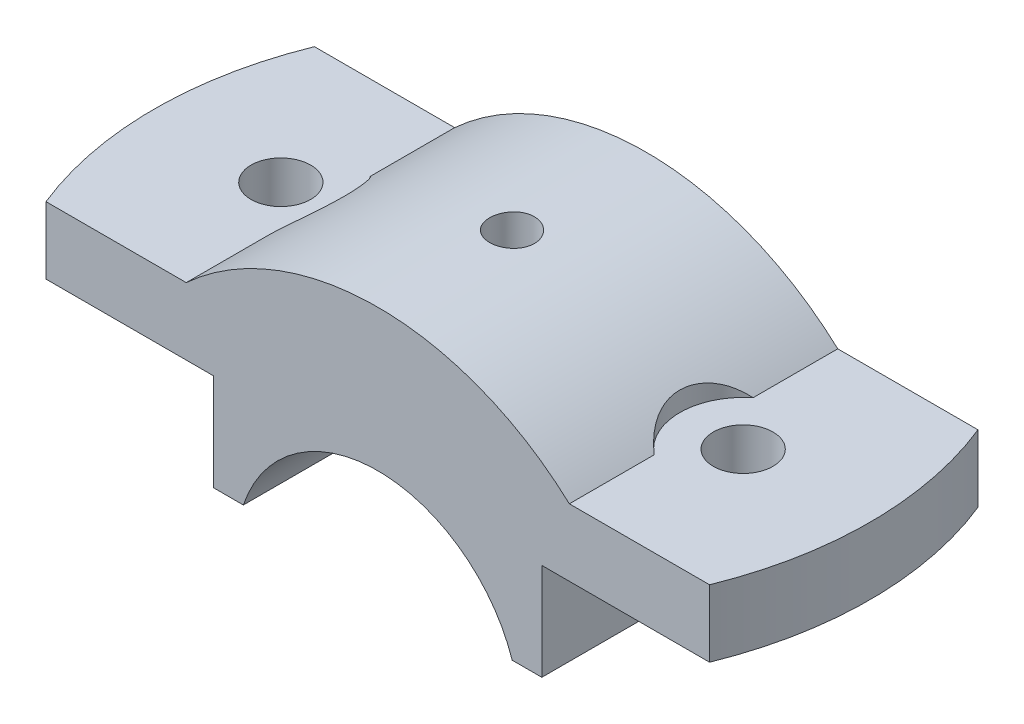
ISO-10303-21;
HEADER;
FILE_DESCRIPTION(('STEP AP214'),'2;1');
FILE_NAME('part.step','',(''),(''),'','','');
FILE_SCHEMA(('AUTOMOTIVE_DESIGN { 1 0 10303 214 1 1 1 1 }'));
ENDSEC;
DATA;
#1=APPLICATION_CONTEXT('core data for automotive mechanical design processes');
#2=APPLICATION_PROTOCOL_DEFINITION('international standard','automotive_design',2000,#1);
#3=PRODUCT_CONTEXT('',#1,'mechanical');
#4=PRODUCT('Part','Part','',(#3));
#5=PRODUCT_RELATED_PRODUCT_CATEGORY('part','',(#4));
#6=PRODUCT_DEFINITION_FORMATION('','',#4);
#7=PRODUCT_DEFINITION_CONTEXT('part definition',#1,'design');
#8=PRODUCT_DEFINITION('design','',#6,#7);
#9=PRODUCT_DEFINITION_SHAPE('','',#8);
#10=(LENGTH_UNIT() NAMED_UNIT(*) SI_UNIT(.MILLI.,.METRE.));
#11=(NAMED_UNIT(*) PLANE_ANGLE_UNIT() SI_UNIT($,.RADIAN.));
#12=(NAMED_UNIT(*) SI_UNIT($,.STERADIAN.) SOLID_ANGLE_UNIT());
#13=UNCERTAINTY_MEASURE_WITH_UNIT(LENGTH_MEASURE(1.E-05),#10,'distance_accuracy_value','');
#14=(GEOMETRIC_REPRESENTATION_CONTEXT(3) GLOBAL_UNCERTAINTY_ASSIGNED_CONTEXT((#13)) GLOBAL_UNIT_ASSIGNED_CONTEXT((#10,
#11,#12)) REPRESENTATION_CONTEXT('',''));
#15=CARTESIAN_POINT('',(0.,0.,0.));
#16=DIRECTION('',(0.,0.,1.));
#17=DIRECTION('',(1.,0.,0.));
#18=AXIS2_PLACEMENT_3D('',#15,#16,#17);
#19=CARTESIAN_POINT('',(0.,-6.,18.));
#20=DIRECTION('',(0.,0.,-1.));
#21=DIRECTION('',(-1.,0.,0.));
#22=AXIS2_PLACEMENT_3D('',#19,#20,#21);
#23=CYLINDRICAL_SURFACE('',#22,38.);
#24=CARTESIAN_POINT('',(0.,32.,2.99999999999998));
#25=CARTESIAN_POINT('',(-0.168230277437706,31.9999984430739,2.99999263868345));
#26=CARTESIAN_POINT('',(-0.336575845655094,31.9988709200709,2.98580169916931));
#27=CARTESIAN_POINT('',(-0.66861139719674,31.9944814128081,2.92939894930332));
#28=CARTESIAN_POINT('',(-0.832295850092006,31.9912169949172,2.88715518982942));
#29=CARTESIAN_POINT('',(-1.15015205512757,31.9829226863334,2.77587406357066));
#30=CARTESIAN_POINT('',(-1.3043290493551,31.9778937789401,2.7068516175222));
#31=CARTESIAN_POINT('',(-1.59887136159142,31.9666348413683,2.54399853963545));
#32=CARTESIAN_POINT('',(-1.73923967362018,31.9604050724332,2.45017330191645));
#33=CARTESIAN_POINT('',(-2.00254103126272,31.9474277075509,2.24014409327317));
#34=CARTESIAN_POINT('',(-2.12543792166292,31.9406790810774,2.12389485639349));
#35=CARTESIAN_POINT('',(-2.34999780988338,31.9274332919605,1.87241281605955));
#36=CARTESIAN_POINT('',(-2.45165988585507,31.9209361402441,1.73717918887837));
#37=CARTESIAN_POINT('',(-2.63098484586301,31.9089176287414,1.45135065682846));
#38=CARTESIAN_POINT('',(-2.70861625469699,31.903397552738,1.30073594623714));
#39=CARTESIAN_POINT('',(-2.8374751023093,31.8939696224707,0.98855884905987));
#40=CARTESIAN_POINT('',(-2.88870296451238,31.8900617423529,0.826996638082306));
#41=CARTESIAN_POINT('',(-2.96319644645852,31.8843090780475,0.497870679819639));
#42=CARTESIAN_POINT('',(-2.98652059882486,31.8824599758018,0.330320257357768));
#43=CARTESIAN_POINT('',(-3.00472536931324,31.8810204867557,-0.00632681714998122));
#44=CARTESIAN_POINT('',(-2.99960647157768,31.8814300615093,-0.175423442828303));
#45=CARTESIAN_POINT('',(-2.9611188626001,31.8844577346025,-0.509962310035281));
#46=CARTESIAN_POINT('',(-2.92781369865022,31.8870708648728,-0.675411913710735));
#47=CARTESIAN_POINT('',(-2.83399765916121,31.8942034046858,-0.998365215123261));
#48=CARTESIAN_POINT('',(-2.77348654183748,31.8987228311701,-1.15586884222906));
#49=CARTESIAN_POINT('',(-2.62690490032726,31.9091644380148,-1.45866214971911));
#50=CARTESIAN_POINT('',(-2.54080579129678,31.9150881856644,-1.60393793599878));
#51=CARTESIAN_POINT('',(-2.34551283184451,31.9276694800349,-1.87799978791043));
#52=CARTESIAN_POINT('',(-2.23631856235735,31.9343270400699,-2.00678555426029));
#53=CARTESIAN_POINT('',(-1.99757813910436,31.947647885739,-2.24458115896056));
#54=CARTESIAN_POINT('',(-1.86797703439472,31.9543111370687,-2.35353583758633));
#55=CARTESIAN_POINT('',(-1.59229376436976,31.9668751419437,-2.54815019879116));
#56=CARTESIAN_POINT('',(-1.44621158946688,31.9727758950454,-2.63380986781871));
#57=CARTESIAN_POINT('',(-1.14167761997913,31.983150993084,-2.77939892547025));
#58=CARTESIAN_POINT('',(-0.983224692335484,31.9876252071703,-2.83932595392174));
#59=CARTESIAN_POINT('',(-0.658463212690174,31.9946415451888,-2.93171041942902));
#60=CARTESIAN_POINT('',(-0.492154807064344,31.997183705107,-2.96416836811961));
#61=CARTESIAN_POINT('',(-0.156881478742684,32.0000448768352,-3.00062434440679));
#62=CARTESIAN_POINT('',(0.0120751089608379,32.0003698415183,-3.00469857910481));
#63=CARTESIAN_POINT('',(0.348269003373997,31.9987758913175,-2.98447098943401));
#64=CARTESIAN_POINT('',(0.515506324442481,31.9968569951891,-2.96016940224687));
#65=CARTESIAN_POINT('',(0.843297753735751,31.9909950041868,-2.88394314979587));
#66=CARTESIAN_POINT('',(1.00386010671882,31.987054491835,-2.83205372367031));
#67=CARTESIAN_POINT('',(1.31399900365978,31.9775920824189,-2.70216068710781));
#68=CARTESIAN_POINT('',(1.46357539119334,31.972070162843,-2.62415670492504));
#69=CARTESIAN_POINT('',(1.7478437504178,31.9600494395666,-2.44405671040128));
#70=CARTESIAN_POINT('',(1.88250358772922,31.953548595394,-2.34191011569744));
#71=CARTESIAN_POINT('',(2.13279217984116,31.9403075453845,-2.11649766051109));
#72=CARTESIAN_POINT('',(2.24842063776817,31.9335673358158,-1.99323147064187));
#73=CARTESIAN_POINT('',(2.4576248497514,31.9205896766453,-1.72874864835165));
#74=CARTESIAN_POINT('',(2.55115094155126,31.9143533795852,-1.58749266904679));
#75=CARTESIAN_POINT('',(2.71315523827199,31.9031055627809,-1.29123629441746));
#76=CARTESIAN_POINT('',(2.78163367119923,31.8980940318878,-1.13623602422189));
#77=CARTESIAN_POINT('',(2.89151387110067,31.8898693720601,-0.817068099787166));
#78=CARTESIAN_POINT('',(2.93294623887223,31.8866542112497,-0.652911034998945));
#79=CARTESIAN_POINT('',(2.98765790023765,31.8823793491511,-0.319943850373173));
#80=CARTESIAN_POINT('',(3.00093767292137,31.8813196111828,-0.151133809767669));
#81=CARTESIAN_POINT('',(2.99896188688674,31.8814760426207,0.185853858942921));
#82=CARTESIAN_POINT('',(2.9837843664471,31.8826859878913,0.354031953001597));
#83=CARTESIAN_POINT('',(2.92548733876921,31.887232237977,0.685442873019107));
#84=CARTESIAN_POINT('',(2.88236778675549,31.8905685461995,0.848675691052984));
#85=CARTESIAN_POINT('',(2.76943001015429,31.8989899804525,1.1655689968701));
#86=CARTESIAN_POINT('',(2.6996129644452,31.9040750292632,1.3192299069707));
#87=CARTESIAN_POINT('',(2.53527109638199,31.9154210711218,1.61266178094886));
#88=CARTESIAN_POINT('',(2.44074672054793,31.9216820429175,1.75243299578315));
#89=CARTESIAN_POINT('',(2.22938062382268,31.9346948182221,2.01451680288399));
#90=CARTESIAN_POINT('',(2.11248130954251,31.941447859921,2.13678288515432));
#91=CARTESIAN_POINT('',(1.85978424897895,31.954672635902,2.36000556130415));
#92=CARTESIAN_POINT('',(1.7239819252655,31.9611443015481,2.46095697881557));
#93=CARTESIAN_POINT('',(1.43709756450133,31.9730876131211,2.6388054256755));
#94=CARTESIAN_POINT('',(1.2859897583193,31.978557527474,2.71566096437292));
#95=CARTESIAN_POINT('',(0.973076064569825,31.9878601967286,2.84281200189949));
#96=CARTESIAN_POINT('',(0.811282773093926,31.9916948408735,2.89313816633251));
#97=CARTESIAN_POINT('',(0.540438770546243,31.9963056825779,2.95292296572032));
#98=CARTESIAN_POINT('',(0.433132098217288,31.9976847801056,2.97055353917026));
#99=CARTESIAN_POINT('',(0.21723297545625,31.9995324404705,2.9940944195064));
#100=CARTESIAN_POINT('',(0.108640528034263,32.0000010054389,3.00000475382509));
#101=CARTESIAN_POINT('',(0.,32.,2.99999999999998));
#102=B_SPLINE_CURVE_WITH_KNOTS('',3,(#24,#25,#26,#27,#28,#29,#30,#31,#32,#33,#34,#35,#36,#37,
#38,#39,#40,#41,#42,#43,#44,#45,#46,#47,#48,#49,#50,#51,#52,#53,#54,#55,#56,#57,#58,#59,#60,#61,
#62,#63,#64,#65,#66,#67,#68,#69,#70,#71,#72,#73,#74,#75,#76,#77,#78,#79,#80,#81,#82,#83,#84,#85,
#86,#87,#88,#89,#90,#91,#92,#93,#94,#95,#96,#97,#98,#99,#100,#101),.UNSPECIFIED.,.T.,.F.,(4,2,2,
2,2,2,2,2,2,2,2,2,2,2,2,2,2,2,2,2,2,2,2,2,2,2,2,2,2,2,2,2,2,2,2,2,2,2,4),(0.,0.504294188546739,
1.00916370078726,1.51375230936013,2.01823126998902,2.52373945491489,3.02926958047039,
3.53545907123701,4.04164044416131,4.54675814609819,5.05186725021793,5.55584058602806,
6.05981840083591,6.5643613490127,7.06891345298726,7.57484819748385,8.08078323629977,
8.58676466907346,9.09273667730808,9.59734968185777,10.1019584685878,10.6059242398502,
11.1098971854694,11.6149355386039,12.1199817691651,12.6261522324057,13.1323180879118,
13.6379102536976,14.1434938154446,14.6476929456064,15.15189288372,15.6560705605013,
16.1602391262258,16.6657233184335,17.1713301290484,17.6778028214877,18.1836887855239,
18.5093549854356,18.8350204230891),.UNSPECIFIED.);
#103=CARTESIAN_POINT('',(0.,32.,2.99999999999998));
#104=VERTEX_POINT('',#103);
#105=EDGE_CURVE('E47',#104,#104,#102,.T.);
#106=ORIENTED_EDGE('',*,*,#105,.T.);
#107=EDGE_LOOP('',(#106));
#108=FACE_BOUND('',#107,.T.);
#109=DIRECTION('',(0.,0.,-1.));
#110=VECTOR('',#109,1.);
#111=CARTESIAN_POINT('',(25.6904651573303,22.,18.));
#112=LINE('',#111,#110);
#113=CARTESIAN_POINT('',(25.6904651573303,22.,18.));
#114=VERTEX_POINT('',#113);
#115=CARTESIAN_POINT('',(25.6904651573303,22.,6.6376833123068));
#116=VERTEX_POINT('',#115);
#117=EDGE_CURVE('E148',#114,#116,#112,.T.);
#118=ORIENTED_EDGE('',*,*,#117,.T.);
#119=CARTESIAN_POINT('',(25.6904651573303,22.,6.6376833123068));
#120=CARTESIAN_POINT('',(25.5360851043424,22.1416681018721,6.51420867249737));
#121=CARTESIAN_POINT('',(25.3836215551735,22.2791823336498,6.38340380017068));
#122=CARTESIAN_POINT('',(25.0841053598261,22.5451833866574,6.10685950724571));
#123=CARTESIAN_POINT('',(24.9370580895264,22.6736613482156,5.96110576476093));
#124=CARTESIAN_POINT('',(24.6491941230388,22.9215085426633,5.653491442262));
#125=CARTESIAN_POINT('',(24.508431723833,23.0408031542341,5.49151942353939));
#126=CARTESIAN_POINT('',(24.2363075607749,23.2682904084011,5.15263687836669));
#127=CARTESIAN_POINT('',(24.1049430857226,23.3764862568107,4.97573069263071));
#128=CARTESIAN_POINT('',(23.8528205053459,23.5815743674557,4.60631493821572));
#129=CARTESIAN_POINT('',(23.7321338833277,23.6783916917415,4.41371469093334));
#130=CARTESIAN_POINT('',(23.5043908446779,23.85908164754,4.01479632179465));
#131=CARTESIAN_POINT('',(23.3973358972541,23.942952883943,3.8084767249227));
#132=CARTESIAN_POINT('',(23.1992536300817,24.0966827286364,3.38422419101504));
#133=CARTESIAN_POINT('',(23.1081729651954,24.1665880882949,3.1663331999127));
#134=CARTESIAN_POINT('',(22.9434688496595,24.2920447623401,2.72008092153074));
#135=CARTESIAN_POINT('',(22.869842066784,24.347598816803,2.49172164276593));
#136=CARTESIAN_POINT('',(22.7499342032062,24.4375648556656,2.05682098381956));
#137=CARTESIAN_POINT('',(22.7013462567531,24.4737833576563,1.85128534823191));
#138=CARTESIAN_POINT('',(22.6194172898017,24.534645499234,1.43551725204115));
#139=CARTESIAN_POINT('',(22.5860747992536,24.5592902548309,1.2252852463389));
#140=CARTESIAN_POINT('',(22.5352129551669,24.5968164834569,0.801799591498528));
#141=CARTESIAN_POINT('',(22.5176992505084,24.6096937569973,0.588544891193922));
#142=CARTESIAN_POINT('',(22.4988301660851,24.6235658271181,0.160939560666235));
#143=CARTESIAN_POINT('',(22.4974739036633,24.624561272785,-0.0534110090511321));
#144=CARTESIAN_POINT('',(22.5103301119086,24.6151119876343,-0.461997479818149));
#145=CARTESIAN_POINT('',(22.5231488228924,24.6056914251709,-0.656303160135775));
#146=CARTESIAN_POINT('',(22.5619809221014,24.5770763766543,-1.04286259298841));
#147=CARTESIAN_POINT('',(22.5879939672906,24.5578821447042,-1.23511639873688));
#148=CARTESIAN_POINT('',(22.6528192304938,24.5098574663833,-1.61613906729809));
#149=CARTESIAN_POINT('',(22.6916259266854,24.4810311771979,-1.80490939654948));
#150=CARTESIAN_POINT('',(22.7814851533843,24.4139289484325,-2.17779604427594));
#151=CARTESIAN_POINT('',(22.8325379785097,24.3756527815061,-2.36191225066403));
#152=CARTESIAN_POINT('',(22.9463727274414,24.2897519777021,-2.72495933677603));
#153=CARTESIAN_POINT('',(23.0091940590921,24.2420959034169,-2.90387039063447));
#154=CARTESIAN_POINT('',(23.1456283742011,24.1378044455699,-3.2548914886335));
#155=CARTESIAN_POINT('',(23.2192449894415,24.0811660396201,-3.4269992191435));
#156=CARTESIAN_POINT('',(23.3763137314078,23.9592695660632,-3.76349373210637));
#157=CARTESIAN_POINT('',(23.4597660818508,23.8940113023904,-3.92788033882066));
#158=CARTESIAN_POINT('',(23.6355270453779,23.7552415450916,-4.24828704232643));
#159=CARTESIAN_POINT('',(23.7278387953854,23.6817271265587,-4.40430414494656));
#160=CARTESIAN_POINT('',(23.9282386479047,23.5204551498758,-4.71995510834892));
#161=CARTESIAN_POINT('',(24.0370002176616,23.432022004933,-4.87881602386906));
#162=CARTESIAN_POINT('',(24.2623844714665,23.2465042091278,-5.1856332961988));
#163=CARTESIAN_POINT('',(24.379010630913,23.1494157272481,-5.33358477081362));
#164=CARTESIAN_POINT('',(24.6187042069683,22.9472618083659,-5.61815393006347));
#165=CARTESIAN_POINT('',(24.7417672458198,22.8422017715012,-5.75477915839728));
#166=CARTESIAN_POINT('',(24.9931857635632,22.6246099475779,-6.01673825944901));
#167=CARTESIAN_POINT('',(25.121541230047,22.5120781780363,-6.14207215863705));
#168=CARTESIAN_POINT('',(25.3239635142993,22.3320696328102,-6.32788833390874));
#169=CARTESIAN_POINT('',(25.3966039536003,22.2669811541268,-6.39227987552886));
#170=CARTESIAN_POINT('',(25.5428336292653,22.1349133065772,-6.5175597465675));
#171=CARTESIAN_POINT('',(25.6164208573994,22.0679376662269,-6.57845434819236));
#172=CARTESIAN_POINT('',(25.6904651573302,22.0000000000002,-6.63768331230706));
#173=B_SPLINE_CURVE_WITH_KNOTS('',3,(#119,#120,#121,#122,#123,#124,#125,#126,#127,#128,#129,
#130,#131,#132,#133,#134,#135,#136,#137,#138,#139,#140,#141,#142,#143,#144,#145,#146,#147,#148,
#149,#150,#151,#152,#153,#154,#155,#156,#157,#158,#159,#160,#161,#162,#163,#164,#165,#166,#167,
#168,#169,#170,#171,#172),.UNSPECIFIED.,.F.,.F.,(4,2,2,2,2,2,2,2,2,2,2,2,2,2,2,2,2,2,2,2,2,2,2,
2,2,2,4),(0.,0.729592400834076,1.45989044138352,2.19560470883999,2.93110586753776,
3.67120763552799,4.41138910352643,5.14904966030397,5.88656927223681,6.52855006409985,
7.1704689396149,7.81261680885221,8.45472959834446,9.03890309081733,9.62306139629815,
10.2069679046447,10.7908884620571,11.3768004587137,11.9629100238154,12.549032922753,
13.1353641263273,13.7703169673958,14.4055522594533,15.040361004022,15.6751682603777,
16.0257258218313,16.3756336015193),.UNSPECIFIED.);
#174=CARTESIAN_POINT('',(25.6904651573303,22.,-6.6376833123068));
#175=VERTEX_POINT('',#174);
#176=EDGE_CURVE('E140',#116,#175,#173,.T.);
#177=ORIENTED_EDGE('',*,*,#176,.T.);
#178=CARTESIAN_POINT('',(25.6904651573303,22.,-18.));
#179=VERTEX_POINT('',#178);
#180=EDGE_CURVE('E145',#175,#179,#112,.T.);
#181=ORIENTED_EDGE('',*,*,#180,.T.);
#182=CARTESIAN_POINT('',(0.,-6.,-18.));
#183=DIRECTION('',(0.,0.,1.));
#184=DIRECTION('',(1.,0.,0.));
#185=AXIS2_PLACEMENT_3D('',#182,#183,#184);
#186=CIRCLE('',#185,38.);
#187=CARTESIAN_POINT('',(-25.6904651573303,22.,-18.));
#188=VERTEX_POINT('',#187);
#189=EDGE_CURVE('E292',#179,#188,#186,.T.);
#190=ORIENTED_EDGE('',*,*,#189,.T.);
#191=DIRECTION('',(0.,0.,-1.));
#192=VECTOR('',#191,1.);
#193=CARTESIAN_POINT('',(-25.6904651573303,22.,18.));
#194=LINE('',#193,#192);
#195=CARTESIAN_POINT('',(-25.6904651573303,22.,-6.63768331230679));
#196=VERTEX_POINT('',#195);
#197=EDGE_CURVE('E159',#196,#188,#194,.T.);
#198=ORIENTED_EDGE('',*,*,#197,.F.);
#199=CARTESIAN_POINT('',(-25.6904651573303,22.,6.6376833123068));
#200=CARTESIAN_POINT('',(-25.5360851043424,22.1416681018721,6.51420867249737));
#201=CARTESIAN_POINT('',(-25.3836215551735,22.2791823336498,6.38340380017068));
#202=CARTESIAN_POINT('',(-25.0841053598261,22.5451833866574,6.10685950724571));
#203=CARTESIAN_POINT('',(-24.9370580895264,22.6736613482156,5.96110576476093));
#204=CARTESIAN_POINT('',(-24.6491941230388,22.9215085426633,5.653491442262));
#205=CARTESIAN_POINT('',(-24.508431723833,23.0408031542341,5.49151942353939));
#206=CARTESIAN_POINT('',(-24.2363075607749,23.2682904084011,5.15263687836669));
#207=CARTESIAN_POINT('',(-24.1049430857226,23.3764862568107,4.97573069263071));
#208=CARTESIAN_POINT('',(-23.8528205053459,23.5815743674557,4.60631493821572));
#209=CARTESIAN_POINT('',(-23.7321338833277,23.6783916917415,4.41371469093334));
#210=CARTESIAN_POINT('',(-23.5043908446779,23.85908164754,4.01479632179465));
#211=CARTESIAN_POINT('',(-23.3973358972541,23.942952883943,3.8084767249227));
#212=CARTESIAN_POINT('',(-23.1992536300817,24.0966827286364,3.38422419101504));
#213=CARTESIAN_POINT('',(-23.1081729651954,24.1665880882949,3.1663331999127));
#214=CARTESIAN_POINT('',(-22.9434688496595,24.2920447623401,2.72008092153074));
#215=CARTESIAN_POINT('',(-22.869842066784,24.347598816803,2.49172164276593));
#216=CARTESIAN_POINT('',(-22.7499342032062,24.4375648556656,2.05682098381956));
#217=CARTESIAN_POINT('',(-22.7013462567531,24.4737833576563,1.85128534823191));
#218=CARTESIAN_POINT('',(-22.6194172898017,24.534645499234,1.43551725204115));
#219=CARTESIAN_POINT('',(-22.5860747992536,24.5592902548309,1.2252852463389));
#220=CARTESIAN_POINT('',(-22.5352129551669,24.5968164834569,0.801799591498528));
#221=CARTESIAN_POINT('',(-22.5176992505084,24.6096937569973,0.588544891193922));
#222=CARTESIAN_POINT('',(-22.4988301660851,24.6235658271181,0.160939560666235));
#223=CARTESIAN_POINT('',(-22.4974739036633,24.624561272785,-0.0534110090511321));
#224=CARTESIAN_POINT('',(-22.5103301119086,24.6151119876343,-0.461997479818149));
#225=CARTESIAN_POINT('',(-22.5231488228924,24.6056914251709,-0.656303160135775));
#226=CARTESIAN_POINT('',(-22.5619809221014,24.5770763766543,-1.04286259298841));
#227=CARTESIAN_POINT('',(-22.5879939672906,24.5578821447042,-1.23511639873688));
#228=CARTESIAN_POINT('',(-22.6528192304938,24.5098574663833,-1.61613906729809));
#229=CARTESIAN_POINT('',(-22.6916259266854,24.4810311771979,-1.80490939654948));
#230=CARTESIAN_POINT('',(-22.7814851533843,24.4139289484325,-2.17779604427594));
#231=CARTESIAN_POINT('',(-22.8325379785097,24.3756527815061,-2.36191225066403));
#232=CARTESIAN_POINT('',(-22.9463727274414,24.2897519777021,-2.72495933677603));
#233=CARTESIAN_POINT('',(-23.0091940590921,24.2420959034169,-2.90387039063447));
#234=CARTESIAN_POINT('',(-23.1456283742011,24.1378044455699,-3.2548914886335));
#235=CARTESIAN_POINT('',(-23.2192449894415,24.0811660396201,-3.4269992191435));
#236=CARTESIAN_POINT('',(-23.3763137314078,23.9592695660632,-3.76349373210637));
#237=CARTESIAN_POINT('',(-23.4597660818508,23.8940113023904,-3.92788033882066));
#238=CARTESIAN_POINT('',(-23.6355270453779,23.7552415450916,-4.24828704232643));
#239=CARTESIAN_POINT('',(-23.7278387953854,23.6817271265587,-4.40430414494656));
#240=CARTESIAN_POINT('',(-23.9282386479047,23.5204551498758,-4.71995510834892));
#241=CARTESIAN_POINT('',(-24.0370002176616,23.432022004933,-4.87881602386906));
#242=CARTESIAN_POINT('',(-24.2623844714665,23.2465042091278,-5.18563329619881));
#243=CARTESIAN_POINT('',(-24.379010630913,23.1494157272481,-5.33358477081362));
#244=CARTESIAN_POINT('',(-24.6187042069683,22.9472618083659,-5.61815393006347));
#245=CARTESIAN_POINT('',(-24.7417672458198,22.8422017715012,-5.75477915839728));
#246=CARTESIAN_POINT('',(-24.9931857635632,22.6246099475779,-6.01673825944901));
#247=CARTESIAN_POINT('',(-25.121541230047,22.5120781780363,-6.14207215863705));
#248=CARTESIAN_POINT('',(-25.3239635142993,22.3320696328102,-6.32788833390874));
#249=CARTESIAN_POINT('',(-25.3966039536003,22.2669811541268,-6.39227987552885));
#250=CARTESIAN_POINT('',(-25.5428336292653,22.1349133065772,-6.5175597465675));
#251=CARTESIAN_POINT('',(-25.6164208573993,22.0679376662269,-6.57845434819235));
#252=CARTESIAN_POINT('',(-25.6904651573302,22.0000000000002,-6.63768331230706));
#253=B_SPLINE_CURVE_WITH_KNOTS('',3,(#199,#200,#201,#202,#203,#204,#205,#206,#207,#208,#209,
#210,#211,#212,#213,#214,#215,#216,#217,#218,#219,#220,#221,#222,#223,#224,#225,#226,#227,#228,
#229,#230,#231,#232,#233,#234,#235,#236,#237,#238,#239,#240,#241,#242,#243,#244,#245,#246,#247,
#248,#249,#250,#251,#252),.UNSPECIFIED.,.F.,.F.,(4,2,2,2,2,2,2,2,2,2,2,2,2,2,2,2,2,2,2,2,2,2,2,
2,2,2,4),(0.,0.729592400834076,1.45989044138352,2.19560470883999,2.93110586753776,
3.67120763552799,4.41138910352643,5.14904966030397,5.88656927223681,6.52855006409985,
7.1704689396149,7.81261680885221,8.45472959834446,9.03890309081733,9.62306139629815,
10.2069679046447,10.7908884620571,11.3768004587137,11.9629100238154,12.549032922753,
13.1353641263273,13.7703169673958,14.4055522594533,15.040361004022,15.6751682603777,
16.0257258218313,16.3756336015193),.UNSPECIFIED.);
#254=CARTESIAN_POINT('',(-25.6904651573303,22.,6.6376833123068));
#255=VERTEX_POINT('',#254);
#256=EDGE_CURVE('E11',#255,#196,#253,.T.);
#257=ORIENTED_EDGE('',*,*,#256,.F.);
#258=CARTESIAN_POINT('',(-25.6904651573303,22.,18.));
#259=VERTEX_POINT('',#258);
#260=EDGE_CURVE('E156',#259,#255,#194,.T.);
#261=ORIENTED_EDGE('',*,*,#260,.F.);
#262=CARTESIAN_POINT('',(0.,-6.,18.));
#263=DIRECTION('',(0.,0.,1.));
#264=DIRECTION('',(1.,0.,0.));
#265=AXIS2_PLACEMENT_3D('',#262,#263,#264);
#266=CIRCLE('',#265,38.);
#267=EDGE_CURVE('E266',#114,#259,#266,.T.);
#268=ORIENTED_EDGE('',*,*,#267,.F.);
#269=EDGE_LOOP('',(#118,#177,#181,#190,#198,#257,#261,#268));
#270=FACE_BOUND('',#269,.T.);
#271=ADVANCED_FACE('F33',(#108,#270),#23,.T.);
#272=CARTESIAN_POINT('',(-50.,22.,18.));
#273=DIRECTION('',(0.,-1.,0.));
#274=DIRECTION('',(1.,0.,0.));
#275=AXIS2_PLACEMENT_3D('',#272,#273,#274);
#276=PLANE('',#275);
#277=CARTESIAN_POINT('',(-31.,22.,0.));
#278=DIRECTION('',(0.,1.,0.));
#279=DIRECTION('',(0.,0.,1.));
#280=AXIS2_PLACEMENT_3D('',#277,#278,#279);
#281=CIRCLE('',#280,4.);
#282=CARTESIAN_POINT('',(-31.,22.,4.));
#283=VERTEX_POINT('',#282);
#284=EDGE_CURVE('E250',#283,#283,#281,.T.);
#285=ORIENTED_EDGE('',*,*,#284,.F.);
#286=EDGE_LOOP('',(#285));
#287=FACE_BOUND('',#286,.T.);
#288=CARTESIAN_POINT('',(0.,22.,0.));
#289=DIRECTION('',(0.,1.,0.));
#290=DIRECTION('',(-1.,0.,0.));
#291=AXIS2_PLACEMENT_3D('',#288,#289,#290);
#292=CIRCLE('',#291,48.);
#293=CARTESIAN_POINT('',(-44.497190922574,22.,-18.));
#294=VERTEX_POINT('',#293);
#295=CARTESIAN_POINT('',(-44.497190922574,22.,18.));
#296=VERTEX_POINT('',#295);
#297=EDGE_CURVE('E254',#294,#296,#292,.T.);
#298=ORIENTED_EDGE('',*,*,#297,.T.);
#299=DIRECTION('',(-1.,0.,0.));
#300=VECTOR('',#299,1.);
#301=CARTESIAN_POINT('',(-50.,22.,18.));
#302=LINE('',#301,#300);
#303=EDGE_CURVE('E256',#259,#296,#302,.T.);
#304=ORIENTED_EDGE('',*,*,#303,.F.);
#305=ORIENTED_EDGE('',*,*,#260,.T.);
#306=CARTESIAN_POINT('',(-31.,22.,0.));
#307=DIRECTION('',(0.,1.,0.));
#308=DIRECTION('',(-1.,0.,0.));
#309=AXIS2_PLACEMENT_3D('',#306,#307,#308);
#310=CIRCLE('',#309,8.5);
#311=EDGE_CURVE('E62',#255,#196,#310,.T.);
#312=ORIENTED_EDGE('',*,*,#311,.T.);
#313=ORIENTED_EDGE('',*,*,#197,.T.);
#314=DIRECTION('',(-1.,0.,0.));
#315=VECTOR('',#314,1.);
#316=CARTESIAN_POINT('',(-50.,22.,-18.));
#317=LINE('',#316,#315);
#318=EDGE_CURVE('E258',#188,#294,#317,.T.);
#319=ORIENTED_EDGE('',*,*,#318,.T.);
#320=EDGE_LOOP('',(#298,#304,#305,#312,#313,#319));
#321=FACE_BOUND('',#320,.T.);
#322=ADVANCED_FACE('F238',(#287,#321),#276,.F.);
#323=CARTESIAN_POINT('',(-22.,13.,18.));
#324=DIRECTION('',(0.,1.,0.));
#325=DIRECTION('',(0.,0.,1.));
#326=AXIS2_PLACEMENT_3D('',#323,#324,#325);
#327=PLANE('',#326);
#328=CARTESIAN_POINT('',(-31.,13.,0.));
#329=DIRECTION('',(0.,1.,0.));
#330=DIRECTION('',(0.,0.,1.));
#331=AXIS2_PLACEMENT_3D('',#328,#329,#330);
#332=CIRCLE('',#331,4.);
#333=CARTESIAN_POINT('',(-31.,13.,4.));
#334=VERTEX_POINT('',#333);
#335=EDGE_CURVE('E284',#334,#334,#332,.T.);
#336=ORIENTED_EDGE('',*,*,#335,.T.);
#337=EDGE_LOOP('',(#336));
#338=FACE_BOUND('',#337,.T.);
#339=CARTESIAN_POINT('',(0.,13.,0.));
#340=DIRECTION('',(0.,1.,0.));
#341=DIRECTION('',(0.,0.,1.));
#342=AXIS2_PLACEMENT_3D('',#339,#340,#341);
#343=CIRCLE('',#342,48.);
#344=CARTESIAN_POINT('',(-44.497190922574,13.,-18.));
#345=VERTEX_POINT('',#344);
#346=CARTESIAN_POINT('',(-44.497190922574,13.,18.));
#347=VERTEX_POINT('',#346);
#348=EDGE_CURVE('E315',#345,#347,#343,.T.);
#349=ORIENTED_EDGE('',*,*,#348,.F.);
#350=DIRECTION('',(1.,0.,0.));
#351=VECTOR('',#350,1.);
#352=CARTESIAN_POINT('',(-22.,13.,-18.));
#353=LINE('',#352,#351);
#354=CARTESIAN_POINT('',(-22.,13.,-18.));
#355=VERTEX_POINT('',#354);
#356=EDGE_CURVE('E295',#345,#355,#353,.T.);
#357=ORIENTED_EDGE('',*,*,#356,.T.);
#358=DIRECTION('',(0.,0.,-1.));
#359=VECTOR('',#358,1.);
#360=CARTESIAN_POINT('',(-22.,13.,18.));
#361=LINE('',#360,#359);
#362=CARTESIAN_POINT('',(-22.,13.,18.));
#363=VERTEX_POINT('',#362);
#364=EDGE_CURVE('E306',#363,#355,#361,.T.);
#365=ORIENTED_EDGE('',*,*,#364,.F.);
#366=DIRECTION('',(1.,0.,0.));
#367=VECTOR('',#366,1.);
#368=CARTESIAN_POINT('',(-22.,13.,18.));
#369=LINE('',#368,#367);
#370=EDGE_CURVE('E268',#347,#363,#369,.T.);
#371=ORIENTED_EDGE('',*,*,#370,.F.);
#372=EDGE_LOOP('',(#349,#357,#365,#371));
#373=FACE_BOUND('',#372,.T.);
#374=ADVANCED_FACE('F225',(#338,#373),#327,.F.);
#375=CARTESIAN_POINT('',(0.,-6.,18.));
#376=DIRECTION('',(0.,0.,1.));
#377=DIRECTION('',(1.,0.,0.));
#378=AXIS2_PLACEMENT_3D('',#375,#376,#377);
#379=PLANE('',#378);
#380=DIRECTION('',(0.,1.,0.));
#381=VECTOR('',#380,1.);
#382=CARTESIAN_POINT('',(44.497190922574,-14.,18.));
#383=LINE('',#382,#381);
#384=CARTESIAN_POINT('',(44.497190922574,13.,18.));
#385=VERTEX_POINT('',#384);
#386=CARTESIAN_POINT('',(44.497190922574,22.,18.));
#387=VERTEX_POINT('',#386);
#388=EDGE_CURVE('E331',#385,#387,#383,.T.);
#389=ORIENTED_EDGE('',*,*,#388,.T.);
#390=DIRECTION('',(-1.,0.,0.));
#391=VECTOR('',#390,1.);
#392=CARTESIAN_POINT('',(50.,22.,18.));
#393=LINE('',#392,#391);
#394=EDGE_CURVE('E272',#387,#114,#393,.T.);
#395=ORIENTED_EDGE('',*,*,#394,.T.);
#396=ORIENTED_EDGE('',*,*,#267,.T.);
#397=ORIENTED_EDGE('',*,*,#303,.T.);
#398=DIRECTION('',(0.,1.,0.));
#399=VECTOR('',#398,1.);
#400=CARTESIAN_POINT('',(-44.497190922574,-14.,18.));
#401=LINE('',#400,#399);
#402=EDGE_CURVE('E260',#347,#296,#401,.T.);
#403=ORIENTED_EDGE('',*,*,#402,.F.);
#404=ORIENTED_EDGE('',*,*,#370,.T.);
#405=DIRECTION('',(0.,-1.,0.));
#406=VECTOR('',#405,1.);
#407=CARTESIAN_POINT('',(-22.,0.,18.));
#408=LINE('',#407,#406);
#409=CARTESIAN_POINT('',(-22.,0.,18.));
#410=VERTEX_POINT('',#409);
#411=EDGE_CURVE('E270',#363,#410,#408,.T.);
#412=ORIENTED_EDGE('',*,*,#411,.T.);
#413=DIRECTION('',(1.,0.,0.));
#414=VECTOR('',#413,1.);
#415=CARTESIAN_POINT('',(-18.0277563773199,0.,18.));
#416=LINE('',#415,#414);
#417=CARTESIAN_POINT('',(-18.0277563773199,0.,18.));
#418=VERTEX_POINT('',#417);
#419=EDGE_CURVE('E277',#410,#418,#416,.T.);
#420=ORIENTED_EDGE('',*,*,#419,.T.);
#421=CARTESIAN_POINT('',(0.,-6.,18.));
#422=DIRECTION('',(0.,0.,-1.));
#423=DIRECTION('',(1.,0.,0.));
#424=AXIS2_PLACEMENT_3D('',#421,#422,#423);
#425=CIRCLE('',#424,19.);
#426=CARTESIAN_POINT('',(18.0277563773199,0.,18.));
#427=VERTEX_POINT('',#426);
#428=EDGE_CURVE('E301',#418,#427,#425,.T.);
#429=ORIENTED_EDGE('',*,*,#428,.T.);
#430=DIRECTION('',(1.,0.,0.));
#431=VECTOR('',#430,1.);
#432=CARTESIAN_POINT('',(18.0277563773199,0.,18.));
#433=LINE('',#432,#431);
#434=CARTESIAN_POINT('',(22.,0.,18.));
#435=VERTEX_POINT('',#434);
#436=EDGE_CURVE('E325',#427,#435,#433,.T.);
#437=ORIENTED_EDGE('',*,*,#436,.T.);
#438=DIRECTION('',(0.,1.,0.));
#439=VECTOR('',#438,1.);
#440=CARTESIAN_POINT('',(22.,0.,18.));
#441=LINE('',#440,#439);
#442=CARTESIAN_POINT('',(22.,13.,18.));
#443=VERTEX_POINT('',#442);
#444=EDGE_CURVE('E327',#435,#443,#441,.T.);
#445=ORIENTED_EDGE('',*,*,#444,.T.);
#446=DIRECTION('',(1.,0.,0.));
#447=VECTOR('',#446,1.);
#448=CARTESIAN_POINT('',(22.,13.,18.));
#449=LINE('',#448,#447);
#450=EDGE_CURVE('E329',#443,#385,#449,.T.);
#451=ORIENTED_EDGE('',*,*,#450,.T.);
#452=EDGE_LOOP('',(#389,#395,#396,#397,#403,#404,#412,#420,#429,#437,#445,#451));
#453=FACE_BOUND('',#452,.T.);
#454=ADVANCED_FACE('F221',(#453),#379,.T.);
#455=CARTESIAN_POINT('',(0.,-6.,-18.));
#456=DIRECTION('',(0.,0.,1.));
#457=DIRECTION('',(1.,0.,0.));
#458=AXIS2_PLACEMENT_3D('',#455,#456,#457);
#459=PLANE('',#458);
#460=DIRECTION('',(-1.,0.,0.));
#461=VECTOR('',#460,1.);
#462=CARTESIAN_POINT('',(50.,22.,-18.));
#463=LINE('',#462,#461);
#464=CARTESIAN_POINT('',(44.497190922574,22.,-18.));
#465=VERTEX_POINT('',#464);
#466=EDGE_CURVE('E154',#465,#179,#463,.T.);
#467=ORIENTED_EDGE('',*,*,#466,.F.);
#468=DIRECTION('',(0.,1.,0.));
#469=VECTOR('',#468,1.);
#470=CARTESIAN_POINT('',(44.497190922574,-14.,-18.));
#471=LINE('',#470,#469);
#472=CARTESIAN_POINT('',(44.497190922574,13.,-18.));
#473=VERTEX_POINT('',#472);
#474=EDGE_CURVE('E349',#473,#465,#471,.T.);
#475=ORIENTED_EDGE('',*,*,#474,.F.);
#476=DIRECTION('',(1.,0.,0.));
#477=VECTOR('',#476,1.);
#478=CARTESIAN_POINT('',(22.,13.,-18.));
#479=LINE('',#478,#477);
#480=CARTESIAN_POINT('',(22.,13.,-18.));
#481=VERTEX_POINT('',#480);
#482=EDGE_CURVE('E288',#481,#473,#479,.T.);
#483=ORIENTED_EDGE('',*,*,#482,.F.);
#484=DIRECTION('',(0.,1.,0.));
#485=VECTOR('',#484,1.);
#486=CARTESIAN_POINT('',(22.,0.,-18.));
#487=LINE('',#486,#485);
#488=CARTESIAN_POINT('',(22.,0.,-18.));
#489=VERTEX_POINT('',#488);
#490=EDGE_CURVE('E286',#489,#481,#487,.T.);
#491=ORIENTED_EDGE('',*,*,#490,.F.);
#492=DIRECTION('',(1.,0.,0.));
#493=VECTOR('',#492,1.);
#494=CARTESIAN_POINT('',(18.0277563773199,0.,-18.));
#495=LINE('',#494,#493);
#496=CARTESIAN_POINT('',(18.0277563773199,0.,-18.));
#497=VERTEX_POINT('',#496);
#498=EDGE_CURVE('E283',#497,#489,#495,.T.);
#499=ORIENTED_EDGE('',*,*,#498,.F.);
#500=CARTESIAN_POINT('',(0.,-6.,-18.));
#501=DIRECTION('',(0.,0.,-1.));
#502=DIRECTION('',(1.,0.,0.));
#503=AXIS2_PLACEMENT_3D('',#500,#501,#502);
#504=CIRCLE('',#503,19.);
#505=CARTESIAN_POINT('',(-18.0277563773199,0.,-18.));
#506=VERTEX_POINT('',#505);
#507=EDGE_CURVE('E280',#506,#497,#504,.T.);
#508=ORIENTED_EDGE('',*,*,#507,.F.);
#509=DIRECTION('',(1.,0.,0.));
#510=VECTOR('',#509,1.);
#511=CARTESIAN_POINT('',(-18.0277563773199,0.,-18.));
#512=LINE('',#511,#510);
#513=CARTESIAN_POINT('',(-22.,0.,-18.));
#514=VERTEX_POINT('',#513);
#515=EDGE_CURVE('E299',#514,#506,#512,.T.);
#516=ORIENTED_EDGE('',*,*,#515,.F.);
#517=DIRECTION('',(0.,-1.,0.));
#518=VECTOR('',#517,1.);
#519=CARTESIAN_POINT('',(-22.,0.,-18.));
#520=LINE('',#519,#518);
#521=EDGE_CURVE('E297',#355,#514,#520,.T.);
#522=ORIENTED_EDGE('',*,*,#521,.F.);
#523=ORIENTED_EDGE('',*,*,#356,.F.);
#524=DIRECTION('',(0.,1.,0.));
#525=VECTOR('',#524,1.);
#526=CARTESIAN_POINT('',(-44.497190922574,-14.,-18.));
#527=LINE('',#526,#525);
#528=EDGE_CURVE('E171',#294,#345,#527,.F.);
#529=ORIENTED_EDGE('',*,*,#528,.F.);
#530=ORIENTED_EDGE('',*,*,#318,.F.);
#531=ORIENTED_EDGE('',*,*,#189,.F.);
#532=EDGE_LOOP('',(#467,#475,#483,#491,#499,#508,#516,#522,#523,#529,#530,#531));
#533=FACE_BOUND('',#532,.T.);
#534=ADVANCED_FACE('F224',(#533),#459,.F.);
#535=CARTESIAN_POINT('',(0.,-6.,18.));
#536=DIRECTION('',(0.,0.,-1.));
#537=DIRECTION('',(-1.,0.,0.));
#538=AXIS2_PLACEMENT_3D('',#535,#536,#537);
#539=CYLINDRICAL_SURFACE('',#538,19.);
#540=CARTESIAN_POINT('',(0.,13.,2.49999999999999));
#541=CARTESIAN_POINT('',(0.139778315489381,12.999997967774,2.49999410094607));
#542=CARTESIAN_POINT('',(0.279642447495432,12.9984412683557,2.48823767475851));
#543=CARTESIAN_POINT('',(0.555474474016764,12.9923810422329,2.44152700403634));
#544=CARTESIAN_POINT('',(0.691438217949602,12.9878744896332,2.40654893872552));
#545=CARTESIAN_POINT('',(0.955436642925262,12.9764219373405,2.31444705906101));
#546=CARTESIAN_POINT('',(1.08347675216936,12.9694776299244,2.25733860465933));
#547=CARTESIAN_POINT('',(1.32813277832855,12.9539206812215,2.12263165454414));
#548=CARTESIAN_POINT('',(1.44475055826477,12.9453083126858,2.04503650793576));
#549=CARTESIAN_POINT('',(1.66398308687909,12.9273173646443,1.87105538112386));
#550=CARTESIAN_POINT('',(1.76651843289981,12.9179348817316,1.77456973952705));
#551=CARTESIAN_POINT('',(1.95399133146886,12.8994924119599,1.56576064733009));
#552=CARTESIAN_POINT('',(2.0389279601093,12.890432442053,1.4534363657436));
#553=CARTESIAN_POINT('',(2.18909162338547,12.8736225658863,1.21561789849417));
#554=CARTESIAN_POINT('',(2.254243636291,12.8658776941045,1.09007595594652));
#555=CARTESIAN_POINT('',(2.36250946256607,12.8526269269547,0.82971330966885));
#556=CARTESIAN_POINT('',(2.40562420041089,12.8471209376663,0.694892995440666));
#557=CARTESIAN_POINT('',(2.46834893112872,12.8390089488849,0.420627771177584));
#558=CARTESIAN_POINT('',(2.48809350572304,12.8363863510935,0.281214139706502));
#559=CARTESIAN_POINT('',(2.50393399543624,12.8342874081065,0.00102942145374085));
#560=CARTESIAN_POINT('',(2.50003096100306,12.8348109231579,-0.139741604753912));
#561=CARTESIAN_POINT('',(2.46879737750757,12.8389298660036,-0.417704097944482));
#562=CARTESIAN_POINT('',(2.44161547626707,12.8425058020086,-0.554912597936804));
#563=CARTESIAN_POINT('',(2.36482786882149,12.852296258763,-0.822803762753465));
#564=CARTESIAN_POINT('',(2.31522166359116,12.8585108382319,-0.953486282278281));
#565=CARTESIAN_POINT('',(2.19483509097755,12.8729003199956,-1.20507533515602));
#566=CARTESIAN_POINT('',(2.12399053069557,12.8810811502029,-1.3259507990106));
#567=CARTESIAN_POINT('',(1.96318413435717,12.8984768576706,-1.55415393130079));
#568=CARTESIAN_POINT('',(1.87322133002782,12.9076917872934,-1.66148091311362));
#569=CARTESIAN_POINT('',(1.67591027855668,12.9262039286229,-1.8604029509214));
#570=CARTESIAN_POINT('',(1.5684339827901,12.9355012293485,-1.95187103488117));
#571=CARTESIAN_POINT('',(1.33958658891131,12.9530645440151,-2.11548884034055));
#572=CARTESIAN_POINT('',(1.21821545257772,12.9613305551191,-2.18763850869799));
#573=CARTESIAN_POINT('',(0.964922757293814,12.9759058695861,-2.31057308687671));
#574=CARTESIAN_POINT('',(0.832997072631038,12.9822144030351,-2.36134959301125));
#575=CARTESIAN_POINT('',(0.562390331231887,12.9921571388021,-2.43999334343768));
#576=CARTESIAN_POINT('',(0.423709625549349,12.9957914799383,-2.4678617769038));
#577=CARTESIAN_POINT('',(0.144626841595052,12.9999582136113,-2.49973268466772));
#578=CARTESIAN_POINT('',(0.00424505397900348,13.0005133278906,-2.50390998199236));
#579=CARTESIAN_POINT('',(-0.275216665266613,12.9985205333266,-2.48874205734629));
#580=CARTESIAN_POINT('',(-0.414296627611642,12.9959726978817,-2.46939739177319));
#581=CARTESIAN_POINT('',(-0.686687509149988,12.9880744020358,-2.40787994096775));
#582=CARTESIAN_POINT('',(-0.820017679004481,12.9827342327916,-2.36579096106223));
#583=CARTESIAN_POINT('',(-1.07772769061604,12.9698488481686,-2.26006706877667));
#584=CARTESIAN_POINT('',(-1.20210719868892,12.9623035506347,-2.19643135362992));
#585=CARTESIAN_POINT('',(-1.43916303555311,12.9457917882835,-2.04900056518348));
#586=CARTESIAN_POINT('',(-1.55176881159961,12.9368174879556,-1.96509294211364));
#587=CARTESIAN_POINT('',(-1.76136182953435,12.9184749473973,-1.77965876593364));
#588=CARTESIAN_POINT('',(-1.85834838132062,12.9091066897838,-1.67813143474596));
#589=CARTESIAN_POINT('',(-2.03457405133124,12.8909615049602,-1.45956767417581));
#590=CARTESIAN_POINT('',(-2.11369695379328,12.882188695812,-1.34243714901302));
#591=CARTESIAN_POINT('',(-2.25114524350548,12.8662967388838,-1.0964463235499));
#592=CARTESIAN_POINT('',(-2.30947108507653,12.8591775549807,-0.96758627956325));
#593=CARTESIAN_POINT('',(-2.40348340588749,12.8474274353122,-0.70216224479824));
#594=CARTESIAN_POINT('',(-2.43923433050313,12.8427894223098,-0.565621407141434));
#595=CARTESIAN_POINT('',(-2.48728896692711,12.8365068588229,-0.288409154438022));
#596=CARTESIAN_POINT('',(-2.49959389747028,12.834862152745,-0.147737954475759));
#597=CARTESIAN_POINT('',(-2.50038325713136,12.8347572836292,0.132585217903333));
#598=CARTESIAN_POINT('',(-2.48905029281034,12.8362727080524,0.272236701943022));
#599=CARTESIAN_POINT('',(-2.44327339157393,12.8422647251658,0.547631014500267));
#600=CARTESIAN_POINT('',(-2.40882946081797,12.8467413170668,0.68337384405953));
#601=CARTESIAN_POINT('',(-2.31786734754336,12.8581434764999,0.947066981095644));
#602=CARTESIAN_POINT('',(-2.26135895042261,12.8650679582854,1.0750207139318));
#603=CARTESIAN_POINT('',(-2.12788991460023,12.8805873470396,1.3196597242388));
#604=CARTESIAN_POINT('',(-2.05092891076782,12.8891822838294,1.4363448004849));
#605=CARTESIAN_POINT('',(-1.87806508524071,12.9071536004537,1.65606643442981));
#606=CARTESIAN_POINT('',(-1.78202633147283,12.916535291463,1.75899562327552));
#607=CARTESIAN_POINT('',(-1.57401834863999,12.9349767535594,1.94734544374448));
#608=CARTESIAN_POINT('',(-1.46204538383397,12.9440364485309,2.03276195806478));
#609=CARTESIAN_POINT('',(-1.22480279057949,12.9608556769231,2.18397223906811));
#610=CARTESIAN_POINT('',(-1.09947920166897,12.9686095798624,2.24968193582438));
#611=CARTESIAN_POINT('',(-0.83954097304368,12.9818871351467,2.35902730105119));
#612=CARTESIAN_POINT('',(-0.704936491101717,12.9874131818538,2.40268668066817));
#613=CARTESIAN_POINT('',(-0.474714442967834,12.9942975150946,2.45637452622467));
#614=CARTESIAN_POINT('',(-0.380541684686487,12.9964253917168,2.47271020697246));
#615=CARTESIAN_POINT('',(-0.19092595858504,12.9992773223142,2.49452491255805));
#616=CARTESIAN_POINT('',(-0.0954830015668617,13.0000013882199,2.50000402966206));
#617=CARTESIAN_POINT('',(0.,13.,2.49999999999999));
#618=B_SPLINE_CURVE_WITH_KNOTS('',3,(#540,#541,#542,#543,#544,#545,#546,#547,#548,#549,#550,
#551,#552,#553,#554,#555,#556,#557,#558,#559,#560,#561,#562,#563,#564,#565,#566,#567,#568,#569,
#570,#571,#572,#573,#574,#575,#576,#577,#578,#579,#580,#581,#582,#583,#584,#585,#586,#587,#588,
#589,#590,#591,#592,#593,#594,#595,#596,#597,#598,#599,#600,#601,#602,#603,#604,#605,#606,#607,
#608,#609,#610,#611,#612,#613,#614,#615,#616,#617),.UNSPECIFIED.,.T.,.F.,(4,2,2,2,2,2,2,2,2,2,2,
2,2,2,2,2,2,2,2,2,2,2,2,2,2,2,2,2,2,2,2,2,2,2,2,2,2,2,4),(0.,0.418986144750715,
0.838402751295032,1.25752877489171,1.67658632335898,2.09791737096997,2.5192705322666,
2.94220203521432,3.36511579450622,3.78558208482052,4.20602969778295,4.62381238038423,
5.04160436068184,5.46067207111285,5.87976101093415,6.30206422391833,6.72436859858556,
7.14683886382432,7.56928719694782,7.98861407741508,8.40793103915518,8.82571338706287,
9.24351130200043,9.66368440831748,10.0838760739927,10.5067272952287,10.9295692785285,
11.3511986374782,11.7728060793191,12.1911686022117,12.6095310136043,13.027708095279,
13.4458926429742,13.8671712161902,14.2885487204711,14.7116990687392,15.1343934209874,
15.4206065905888,15.7068173277526),.UNSPECIFIED.);
#619=CARTESIAN_POINT('',(0.,13.,2.49999999999999));
#620=VERTEX_POINT('',#619);
#621=EDGE_CURVE('E177',#620,#620,#618,.T.);
#622=ORIENTED_EDGE('',*,*,#621,.T.);
#623=EDGE_LOOP('',(#622));
#624=FACE_BOUND('',#623,.T.);
#625=ORIENTED_EDGE('',*,*,#507,.T.);
#626=DIRECTION('',(0.,0.,-1.));
#627=VECTOR('',#626,1.);
#628=CARTESIAN_POINT('',(18.0277563773199,0.,18.));
#629=LINE('',#628,#627);
#630=EDGE_CURVE('E168',#427,#497,#629,.T.);
#631=ORIENTED_EDGE('',*,*,#630,.F.);
#632=ORIENTED_EDGE('',*,*,#428,.F.);
#633=DIRECTION('',(0.,0.,-1.));
#634=VECTOR('',#633,1.);
#635=CARTESIAN_POINT('',(-18.0277563773199,0.,18.));
#636=LINE('',#635,#634);
#637=EDGE_CURVE('E279',#418,#506,#636,.T.);
#638=ORIENTED_EDGE('',*,*,#637,.T.);
#639=EDGE_LOOP('',(#625,#631,#632,#638));
#640=FACE_BOUND('',#639,.T.);
#641=ADVANCED_FACE('F35',(#624,#640),#539,.F.);
#642=CARTESIAN_POINT('',(18.0277563773199,0.,18.));
#643=DIRECTION('',(0.,1.,0.));
#644=DIRECTION('',(-1.,0.,0.));
#645=AXIS2_PLACEMENT_3D('',#642,#643,#644);
#646=PLANE('',#645);
#647=ORIENTED_EDGE('',*,*,#498,.T.);
#648=DIRECTION('',(0.,0.,-1.));
#649=VECTOR('',#648,1.);
#650=CARTESIAN_POINT('',(22.,0.,18.));
#651=LINE('',#650,#649);
#652=EDGE_CURVE('E165',#435,#489,#651,.T.);
#653=ORIENTED_EDGE('',*,*,#652,.F.);
#654=ORIENTED_EDGE('',*,*,#436,.F.);
#655=ORIENTED_EDGE('',*,*,#630,.T.);
#656=EDGE_LOOP('',(#647,#653,#654,#655));
#657=FACE_BOUND('',#656,.T.);
#658=ADVANCED_FACE('F377',(#657),#646,.F.);
#659=CARTESIAN_POINT('',(22.,0.,18.));
#660=DIRECTION('',(-1.,0.,0.));
#661=DIRECTION('',(0.,0.,1.));
#662=AXIS2_PLACEMENT_3D('',#659,#660,#661);
#663=PLANE('',#662);
#664=ORIENTED_EDGE('',*,*,#490,.T.);
#665=DIRECTION('',(0.,0.,-1.));
#666=VECTOR('',#665,1.);
#667=CARTESIAN_POINT('',(22.,13.,18.));
#668=LINE('',#667,#666);
#669=EDGE_CURVE('E158',#443,#481,#668,.T.);
#670=ORIENTED_EDGE('',*,*,#669,.F.);
#671=ORIENTED_EDGE('',*,*,#444,.F.);
#672=ORIENTED_EDGE('',*,*,#652,.T.);
#673=EDGE_LOOP('',(#664,#670,#671,#672));
#674=FACE_BOUND('',#673,.T.);
#675=ADVANCED_FACE('F365',(#674),#663,.F.);
#676=CARTESIAN_POINT('',(22.,13.,18.));
#677=DIRECTION('',(0.,1.,0.));
#678=DIRECTION('',(0.,0.,1.));
#679=AXIS2_PLACEMENT_3D('',#676,#677,#678);
#680=PLANE('',#679);
#681=CARTESIAN_POINT('',(31.,13.,0.));
#682=DIRECTION('',(0.,1.,0.));
#683=DIRECTION('',(0.,0.,1.));
#684=AXIS2_PLACEMENT_3D('',#681,#682,#683);
#685=CIRCLE('',#684,4.);
#686=CARTESIAN_POINT('',(31.,13.,4.));
#687=VERTEX_POINT('',#686);
#688=EDGE_CURVE('E261',#687,#687,#685,.T.);
#689=ORIENTED_EDGE('',*,*,#688,.T.);
#690=EDGE_LOOP('',(#689));
#691=FACE_BOUND('',#690,.T.);
#692=ORIENTED_EDGE('',*,*,#482,.T.);
#693=CARTESIAN_POINT('',(0.,13.,0.));
#694=DIRECTION('',(0.,1.,0.));
#695=DIRECTION('',(0.,0.,1.));
#696=AXIS2_PLACEMENT_3D('',#693,#694,#695);
#697=CIRCLE('',#696,48.);
#698=EDGE_CURVE('E351',#473,#385,#697,.F.);
#699=ORIENTED_EDGE('',*,*,#698,.T.);
#700=ORIENTED_EDGE('',*,*,#450,.F.);
#701=ORIENTED_EDGE('',*,*,#669,.T.);
#702=EDGE_LOOP('',(#692,#699,#700,#701));
#703=FACE_BOUND('',#702,.T.);
#704=ADVANCED_FACE('F361',(#691,#703),#680,.F.);
#705=CARTESIAN_POINT('',(50.,22.,18.));
#706=DIRECTION('',(0.,-1.,0.));
#707=DIRECTION('',(1.,0.,0.));
#708=AXIS2_PLACEMENT_3D('',#705,#706,#707);
#709=PLANE('',#708);
#710=CARTESIAN_POINT('',(31.,22.,0.));
#711=DIRECTION('',(0.,1.,0.));
#712=DIRECTION('',(0.,0.,1.));
#713=AXIS2_PLACEMENT_3D('',#710,#711,#712);
#714=CIRCLE('',#713,4.);
#715=CARTESIAN_POINT('',(31.,22.,4.));
#716=VERTEX_POINT('',#715);
#717=EDGE_CURVE('E355',#716,#716,#714,.T.);
#718=ORIENTED_EDGE('',*,*,#717,.F.);
#719=EDGE_LOOP('',(#718));
#720=FACE_BOUND('',#719,.T.);
#721=ORIENTED_EDGE('',*,*,#394,.F.);
#722=CARTESIAN_POINT('',(0.,22.,0.));
#723=DIRECTION('',(0.,-1.,0.));
#724=DIRECTION('',(1.,0.,0.));
#725=AXIS2_PLACEMENT_3D('',#722,#723,#724);
#726=CIRCLE('',#725,48.);
#727=EDGE_CURVE('E347',#465,#387,#726,.T.);
#728=ORIENTED_EDGE('',*,*,#727,.F.);
#729=ORIENTED_EDGE('',*,*,#466,.T.);
#730=ORIENTED_EDGE('',*,*,#180,.F.);
#731=CARTESIAN_POINT('',(31.,22.,0.));
#732=DIRECTION('',(0.,-1.,0.));
#733=DIRECTION('',(1.,0.,0.));
#734=AXIS2_PLACEMENT_3D('',#731,#732,#733);
#735=CIRCLE('',#734,8.5);
#736=EDGE_CURVE('E54',#116,#175,#735,.T.);
#737=ORIENTED_EDGE('',*,*,#736,.F.);
#738=ORIENTED_EDGE('',*,*,#117,.F.);
#739=EDGE_LOOP('',(#721,#728,#729,#730,#737,#738));
#740=FACE_BOUND('',#739,.T.);
#741=ADVANCED_FACE('F151',(#720,#740),#709,.F.);
#742=CARTESIAN_POINT('',(-22.,0.,18.));
#743=DIRECTION('',(1.,0.,0.));
#744=DIRECTION('',(0.,0.,-1.));
#745=AXIS2_PLACEMENT_3D('',#742,#743,#744);
#746=PLANE('',#745);
#747=ORIENTED_EDGE('',*,*,#521,.T.);
#748=DIRECTION('',(0.,0.,-1.));
#749=VECTOR('',#748,1.);
#750=CARTESIAN_POINT('',(-22.,0.,18.));
#751=LINE('',#750,#749);
#752=EDGE_CURVE('E304',#410,#514,#751,.T.);
#753=ORIENTED_EDGE('',*,*,#752,.F.);
#754=ORIENTED_EDGE('',*,*,#411,.F.);
#755=ORIENTED_EDGE('',*,*,#364,.T.);
#756=EDGE_LOOP('',(#747,#753,#754,#755));
#757=FACE_BOUND('',#756,.T.);
#758=ADVANCED_FACE('F232',(#757),#746,.F.);
#759=CARTESIAN_POINT('',(-18.0277563773199,0.,18.));
#760=DIRECTION('',(0.,1.,0.));
#761=DIRECTION('',(-1.,0.,0.));
#762=AXIS2_PLACEMENT_3D('',#759,#760,#761);
#763=PLANE('',#762);
#764=ORIENTED_EDGE('',*,*,#515,.T.);
#765=ORIENTED_EDGE('',*,*,#637,.F.);
#766=ORIENTED_EDGE('',*,*,#419,.F.);
#767=ORIENTED_EDGE('',*,*,#752,.T.);
#768=EDGE_LOOP('',(#764,#765,#766,#767));
#769=FACE_BOUND('',#768,.T.);
#770=ADVANCED_FACE('F219',(#769),#763,.F.);
#771=CARTESIAN_POINT('',(-31.,22.,0.));
#772=DIRECTION('',(0.,1.,0.));
#773=DIRECTION('',(0.,0.,1.));
#774=AXIS2_PLACEMENT_3D('',#771,#772,#773);
#775=CYLINDRICAL_SURFACE('',#774,4.);
#776=ORIENTED_EDGE('',*,*,#284,.T.);
#777=EDGE_LOOP('',(#776));
#778=FACE_BOUND('',#777,.T.);
#779=ORIENTED_EDGE('',*,*,#335,.F.);
#780=EDGE_LOOP('',(#779));
#781=FACE_BOUND('',#780,.T.);
#782=ADVANCED_FACE('F215',(#778,#781),#775,.F.);
#783=CARTESIAN_POINT('',(0.,-14.,0.));
#784=DIRECTION('',(0.,1.,0.));
#785=DIRECTION('',(-1.,0.,0.));
#786=AXIS2_PLACEMENT_3D('',#783,#784,#785);
#787=CYLINDRICAL_SURFACE('',#786,48.);
#788=ORIENTED_EDGE('',*,*,#348,.T.);
#789=ORIENTED_EDGE('',*,*,#402,.T.);
#790=ORIENTED_EDGE('',*,*,#297,.F.);
#791=ORIENTED_EDGE('',*,*,#528,.T.);
#792=EDGE_LOOP('',(#788,#789,#790,#791));
#793=FACE_BOUND('',#792,.T.);
#794=ADVANCED_FACE('F211',(#793),#787,.T.);
#795=CARTESIAN_POINT('',(31.,22.,0.));
#796=DIRECTION('',(0.,1.,0.));
#797=DIRECTION('',(0.,0.,1.));
#798=AXIS2_PLACEMENT_3D('',#795,#796,#797);
#799=CYLINDRICAL_SURFACE('',#798,4.);
#800=ORIENTED_EDGE('',*,*,#717,.T.);
#801=EDGE_LOOP('',(#800));
#802=FACE_BOUND('',#801,.T.);
#803=ORIENTED_EDGE('',*,*,#688,.F.);
#804=EDGE_LOOP('',(#803));
#805=FACE_BOUND('',#804,.T.);
#806=ADVANCED_FACE('F207',(#802,#805),#799,.F.);
#807=CARTESIAN_POINT('',(0.,-14.,0.));
#808=DIRECTION('',(0.,1.,0.));
#809=DIRECTION('',(-1.,0.,0.));
#810=AXIS2_PLACEMENT_3D('',#807,#808,#809);
#811=CYLINDRICAL_SURFACE('',#810,48.);
#812=ORIENTED_EDGE('',*,*,#474,.T.);
#813=ORIENTED_EDGE('',*,*,#727,.T.);
#814=ORIENTED_EDGE('',*,*,#388,.F.);
#815=ORIENTED_EDGE('',*,*,#698,.F.);
#816=EDGE_LOOP('',(#812,#813,#814,#815));
#817=FACE_BOUND('',#816,.T.);
#818=ADVANCED_FACE('F203',(#817),#811,.T.);
#819=CARTESIAN_POINT('',(0.,32.,0.));
#820=DIRECTION('',(0.,1.,0.));
#821=DIRECTION('',(0.,0.,1.));
#822=AXIS2_PLACEMENT_3D('',#819,#820,#821);
#823=CYLINDRICAL_SURFACE('',#822,2.49999999999999);
#824=CARTESIAN_POINT('',(0.,18.505,0.));
#825=DIRECTION('',(0.,1.,0.));
#826=DIRECTION('',(0.,0.,1.));
#827=AXIS2_PLACEMENT_3D('',#824,#825,#826);
#828=CIRCLE('',#827,2.5);
#829=CARTESIAN_POINT('',(0.,18.505,2.5));
#830=VERTEX_POINT('',#829);
#831=EDGE_CURVE('E344',#830,#830,#828,.T.);
#832=ORIENTED_EDGE('',*,*,#831,.T.);
#833=EDGE_LOOP('',(#832));
#834=FACE_BOUND('',#833,.T.);
#835=ORIENTED_EDGE('',*,*,#621,.F.);
#836=EDGE_LOOP('',(#835));
#837=FACE_BOUND('',#836,.T.);
#838=ADVANCED_FACE('F189',(#834,#837),#823,.F.);
#839=CARTESIAN_POINT('',(0.,32.,0.));
#840=DIRECTION('',(0.,1.,0.));
#841=DIRECTION('',(0.,0.,1.));
#842=AXIS2_PLACEMENT_3D('',#839,#840,#841);
#843=CYLINDRICAL_SURFACE('',#842,2.99999999999998);
#844=CARTESIAN_POINT('',(0.,19.,0.));
#845=DIRECTION('',(0.,1.,0.));
#846=DIRECTION('',(0.,0.,1.));
#847=AXIS2_PLACEMENT_3D('',#844,#845,#846);
#848=CIRCLE('',#847,2.99999999999998);
#849=CARTESIAN_POINT('',(0.,19.,2.99999999999998));
#850=VERTEX_POINT('',#849);
#851=EDGE_CURVE('E333',#850,#850,#848,.T.);
#852=ORIENTED_EDGE('',*,*,#851,.F.);
#853=EDGE_LOOP('',(#852));
#854=FACE_BOUND('',#853,.T.);
#855=ORIENTED_EDGE('',*,*,#105,.F.);
#856=EDGE_LOOP('',(#855));
#857=FACE_BOUND('',#856,.T.);
#858=ADVANCED_FACE('F184',(#854,#857),#843,.F.);
#859=CARTESIAN_POINT('',(0.,19.,0.));
#860=DIRECTION('',(0.,1.,0.));
#861=DIRECTION('',(0.,0.,1.));
#862=AXIS2_PLACEMENT_3D('',#859,#860,#861);
#863=CONICAL_SURFACE('',#862,2.995,0.78539816339745);
#864=ORIENTED_EDGE('',*,*,#831,.F.);
#865=EDGE_LOOP('',(#864));
#866=FACE_BOUND('',#865,.T.);
#867=CARTESIAN_POINT('',(0.,19.,0.));
#868=DIRECTION('',(0.,1.,0.));
#869=DIRECTION('',(0.,0.,1.));
#870=AXIS2_PLACEMENT_3D('',#867,#868,#869);
#871=CIRCLE('',#870,2.995);
#872=CARTESIAN_POINT('',(0.,19.,2.995));
#873=VERTEX_POINT('',#872);
#874=EDGE_CURVE('E336',#873,#873,#871,.T.);
#875=ORIENTED_EDGE('',*,*,#874,.T.);
#876=EDGE_LOOP('',(#875));
#877=FACE_BOUND('',#876,.T.);
#878=ADVANCED_FACE('F188',(#866,#877),#863,.F.);
#879=CARTESIAN_POINT('',(2.995,19.,0.));
#880=DIRECTION('',(0.,-1.,0.));
#881=DIRECTION('',(0.,0.,-1.));
#882=AXIS2_PLACEMENT_3D('',#879,#880,#881);
#883=PLANE('',#882);
#884=ORIENTED_EDGE('',*,*,#874,.F.);
#885=EDGE_LOOP('',(#884));
#886=FACE_BOUND('',#885,.T.);
#887=ORIENTED_EDGE('',*,*,#851,.T.);
#888=EDGE_LOOP('',(#887));
#889=FACE_BOUND('',#888,.T.);
#890=ADVANCED_FACE('F194',(#886,#889),#883,.F.);
#891=CARTESIAN_POINT('',(-31.,58.,0.));
#892=DIRECTION('',(0.,-1.,0.));
#893=DIRECTION('',(1.,0.,0.));
#894=AXIS2_PLACEMENT_3D('',#891,#892,#893);
#895=CYLINDRICAL_SURFACE('',#894,8.5);
#896=ORIENTED_EDGE('',*,*,#256,.T.);
#897=ORIENTED_EDGE('',*,*,#311,.F.);
#898=EDGE_LOOP('',(#896,#897));
#899=FACE_BOUND('',#898,.T.);
#900=ADVANCED_FACE('F191',(#899),#895,.F.);
#901=CARTESIAN_POINT('',(31.,58.,0.));
#902=DIRECTION('',(0.,-1.,0.));
#903=DIRECTION('',(1.,0.,0.));
#904=AXIS2_PLACEMENT_3D('',#901,#902,#903);
#905=CYLINDRICAL_SURFACE('',#904,8.5);
#906=ORIENTED_EDGE('',*,*,#736,.T.);
#907=ORIENTED_EDGE('',*,*,#176,.F.);
#908=EDGE_LOOP('',(#906,#907));
#909=FACE_BOUND('',#908,.T.);
#910=ADVANCED_FACE('F139',(#909),#905,.F.);
#911=CLOSED_SHELL('',(#271,#322,#374,#454,#534,#641,#658,#675,#704,#741,#758,#770,#782,#794,
#806,#818,#838,#858,#878,#890,#900,#910));
#912=MANIFOLD_SOLID_BREP('B2',#911);
#913=ADVANCED_BREP_SHAPE_REPRESENTATION('',(#18,#912),#14);
#914=SHAPE_DEFINITION_REPRESENTATION(#9,#913);
ENDSEC;
END-ISO-10303-21;
